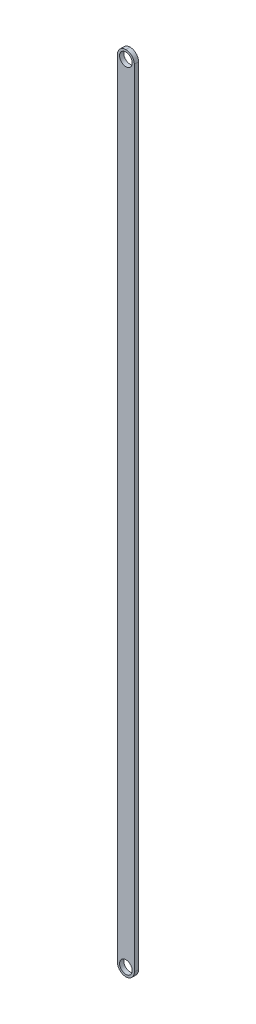
ISO-10303-21;
HEADER;
FILE_DESCRIPTION(('STEP AP214'),'2;1');
FILE_NAME('part.step','',(''),(''),'','','');
FILE_SCHEMA(('AUTOMOTIVE_DESIGN { 1 0 10303 214 1 1 1 1 }'));
ENDSEC;
DATA;
#1=APPLICATION_CONTEXT('core data for automotive mechanical design processes');
#2=APPLICATION_PROTOCOL_DEFINITION('international standard','automotive_design',2000,#1);
#3=PRODUCT_CONTEXT('',#1,'mechanical');
#4=PRODUCT('Part','Part','',(#3));
#5=PRODUCT_RELATED_PRODUCT_CATEGORY('part','',(#4));
#6=PRODUCT_DEFINITION_FORMATION('','',#4);
#7=PRODUCT_DEFINITION_CONTEXT('part definition',#1,'design');
#8=PRODUCT_DEFINITION('design','',#6,#7);
#9=PRODUCT_DEFINITION_SHAPE('','',#8);
#10=(LENGTH_UNIT() NAMED_UNIT(*) SI_UNIT(.MILLI.,.METRE.));
#11=(NAMED_UNIT(*) PLANE_ANGLE_UNIT() SI_UNIT($,.RADIAN.));
#12=(NAMED_UNIT(*) SI_UNIT($,.STERADIAN.) SOLID_ANGLE_UNIT());
#13=UNCERTAINTY_MEASURE_WITH_UNIT(LENGTH_MEASURE(1.E-05),#10,'distance_accuracy_value','');
#14=(GEOMETRIC_REPRESENTATION_CONTEXT(3) GLOBAL_UNCERTAINTY_ASSIGNED_CONTEXT((#13)) GLOBAL_UNIT_ASSIGNED_CONTEXT((#10,
#11,#12)) REPRESENTATION_CONTEXT('',''));
#15=CARTESIAN_POINT('',(0.,0.,0.));
#16=DIRECTION('',(0.,0.,1.));
#17=DIRECTION('',(1.,0.,0.));
#18=AXIS2_PLACEMENT_3D('',#15,#16,#17);
#19=CARTESIAN_POINT('',(0.,0.,0.5));
#20=DIRECTION('',(0.,0.,1.));
#21=DIRECTION('',(1.,0.,0.));
#22=AXIS2_PLACEMENT_3D('',#19,#20,#21);
#23=PLANE('',#22);
#24=CARTESIAN_POINT('',(0.,-46.5000000000005,0.5));
#25=DIRECTION('',(0.,0.,1.));
#26=DIRECTION('',(1.,0.,0.));
#27=AXIS2_PLACEMENT_3D('',#24,#25,#26);
#28=CIRCLE('',#27,0.750000000000001);
#29=CARTESIAN_POINT('',(0.750000000000012,-46.5000000000005,0.5));
#30=VERTEX_POINT('',#29);
#31=EDGE_CURVE('E125',#30,#30,#28,.T.);
#32=ORIENTED_EDGE('',*,*,#31,.F.);
#33=EDGE_LOOP('',(#32));
#34=FACE_BOUND('',#33,.T.);
#35=CARTESIAN_POINT('',(0.,-46.5000000000005,0.5));
#36=DIRECTION('',(0.,0.,1.));
#37=DIRECTION('',(1.,0.,0.));
#38=AXIS2_PLACEMENT_3D('',#35,#36,#37);
#39=CIRCLE('',#38,1.);
#40=CARTESIAN_POINT('',(-1.00000000000001,-46.5000000000005,0.5));
#41=VERTEX_POINT('',#40);
#42=CARTESIAN_POINT('',(0.,-47.5000000000005,0.5));
#43=VERTEX_POINT('',#42);
#44=EDGE_CURVE('E57',#41,#43,#39,.T.);
#45=ORIENTED_EDGE('',*,*,#44,.T.);
#46=CARTESIAN_POINT('',(0.,-46.5000000000005,0.5));
#47=DIRECTION('',(0.,0.,1.));
#48=DIRECTION('',(1.,0.,0.));
#49=AXIS2_PLACEMENT_3D('',#46,#47,#48);
#50=CIRCLE('',#49,1.);
#51=CARTESIAN_POINT('',(0.999999999999992,-46.5000000000005,0.5));
#52=VERTEX_POINT('',#51);
#53=EDGE_CURVE('E153',#43,#52,#50,.T.);
#54=ORIENTED_EDGE('',*,*,#53,.T.);
#55=DIRECTION('',(0.,1.,0.));
#56=VECTOR('',#55,1.);
#57=CARTESIAN_POINT('',(0.999999999999987,47.4999999999995,0.5));
#58=LINE('',#57,#56);
#59=CARTESIAN_POINT('',(0.999999999999987,46.4999999999995,0.5));
#60=VERTEX_POINT('',#59);
#61=EDGE_CURVE('E115',#52,#60,#58,.T.);
#62=ORIENTED_EDGE('',*,*,#61,.T.);
#63=CARTESIAN_POINT('',(0.,46.4999999999995,0.5));
#64=DIRECTION('',(0.,0.,1.));
#65=DIRECTION('',(1.,0.,0.));
#66=AXIS2_PLACEMENT_3D('',#63,#64,#65);
#67=CIRCLE('',#66,1.);
#68=CARTESIAN_POINT('',(0.,47.4999999999995,0.5));
#69=VERTEX_POINT('',#68);
#70=EDGE_CURVE('E105',#60,#69,#67,.T.);
#71=ORIENTED_EDGE('',*,*,#70,.T.);
#72=CARTESIAN_POINT('',(0.,46.4999999999995,0.5));
#73=DIRECTION('',(0.,0.,1.));
#74=DIRECTION('',(1.,0.,0.));
#75=AXIS2_PLACEMENT_3D('',#72,#73,#74);
#76=CIRCLE('',#75,1.);
#77=CARTESIAN_POINT('',(-0.999999999999989,46.4999999999995,0.5));
#78=VERTEX_POINT('',#77);
#79=EDGE_CURVE('E148',#69,#78,#76,.T.);
#80=ORIENTED_EDGE('',*,*,#79,.T.);
#81=DIRECTION('',(0.,-1.,0.));
#82=VECTOR('',#81,1.);
#83=CARTESIAN_POINT('',(-0.999999999999989,47.4999999999995,0.5));
#84=LINE('',#83,#82);
#85=EDGE_CURVE('E134',#78,#41,#84,.T.);
#86=ORIENTED_EDGE('',*,*,#85,.T.);
#87=EDGE_LOOP('',(#45,#54,#62,#71,#80,#86));
#88=FACE_BOUND('',#87,.T.);
#89=CARTESIAN_POINT('',(0.,46.4999999999995,0.5));
#90=DIRECTION('',(0.,0.,1.));
#91=DIRECTION('',(1.,0.,0.));
#92=AXIS2_PLACEMENT_3D('',#89,#90,#91);
#93=CIRCLE('',#92,0.750000000000001);
#94=CARTESIAN_POINT('',(0.75,46.4999999999995,0.5));
#95=VERTEX_POINT('',#94);
#96=EDGE_CURVE('E163',#95,#95,#93,.T.);
#97=ORIENTED_EDGE('',*,*,#96,.F.);
#98=EDGE_LOOP('',(#97));
#99=FACE_BOUND('',#98,.T.);
#100=ADVANCED_FACE('F39',(#34,#88,#99),#23,.T.);
#101=CARTESIAN_POINT('',(0.,0.,0.));
#102=DIRECTION('',(0.,0.,1.));
#103=DIRECTION('',(1.,0.,0.));
#104=AXIS2_PLACEMENT_3D('',#101,#102,#103);
#105=PLANE('',#104);
#106=DIRECTION('',(0.,1.,0.));
#107=VECTOR('',#106,1.);
#108=CARTESIAN_POINT('',(0.999999999999987,47.4999999999995,0.));
#109=LINE('',#108,#107);
#110=CARTESIAN_POINT('',(0.999999999999992,-46.5000000000005,0.));
#111=VERTEX_POINT('',#110);
#112=CARTESIAN_POINT('',(0.999999999999987,46.4999999999995,0.));
#113=VERTEX_POINT('',#112);
#114=EDGE_CURVE('E112',#111,#113,#109,.T.);
#115=ORIENTED_EDGE('',*,*,#114,.F.);
#116=CARTESIAN_POINT('',(0.,-46.5000000000005,0.));
#117=DIRECTION('',(0.,0.,1.));
#118=DIRECTION('',(1.,0.,0.));
#119=AXIS2_PLACEMENT_3D('',#116,#117,#118);
#120=CIRCLE('',#119,1.);
#121=CARTESIAN_POINT('',(0.,-47.5000000000005,0.));
#122=VERTEX_POINT('',#121);
#123=EDGE_CURVE('E95',#111,#122,#120,.F.);
#124=ORIENTED_EDGE('',*,*,#123,.T.);
#125=CARTESIAN_POINT('',(0.,-46.5000000000005,0.));
#126=DIRECTION('',(0.,0.,1.));
#127=DIRECTION('',(1.,0.,0.));
#128=AXIS2_PLACEMENT_3D('',#125,#126,#127);
#129=CIRCLE('',#128,1.);
#130=CARTESIAN_POINT('',(-1.00000000000001,-46.5000000000005,0.));
#131=VERTEX_POINT('',#130);
#132=EDGE_CURVE('E106',#122,#131,#129,.F.);
#133=ORIENTED_EDGE('',*,*,#132,.T.);
#134=DIRECTION('',(0.,-1.,0.));
#135=VECTOR('',#134,1.);
#136=CARTESIAN_POINT('',(-0.999999999999989,47.4999999999995,0.));
#137=LINE('',#136,#135);
#138=CARTESIAN_POINT('',(-0.999999999999989,46.4999999999995,0.));
#139=VERTEX_POINT('',#138);
#140=EDGE_CURVE('E124',#139,#131,#137,.T.);
#141=ORIENTED_EDGE('',*,*,#140,.F.);
#142=CARTESIAN_POINT('',(0.,46.4999999999995,0.));
#143=DIRECTION('',(0.,0.,1.));
#144=DIRECTION('',(1.,0.,0.));
#145=AXIS2_PLACEMENT_3D('',#142,#143,#144);
#146=CIRCLE('',#145,1.);
#147=CARTESIAN_POINT('',(0.,47.4999999999995,0.));
#148=VERTEX_POINT('',#147);
#149=EDGE_CURVE('E141',#139,#148,#146,.F.);
#150=ORIENTED_EDGE('',*,*,#149,.T.);
#151=CARTESIAN_POINT('',(0.,46.4999999999995,0.));
#152=DIRECTION('',(0.,0.,1.));
#153=DIRECTION('',(1.,0.,0.));
#154=AXIS2_PLACEMENT_3D('',#151,#152,#153);
#155=CIRCLE('',#154,1.);
#156=EDGE_CURVE('E117',#148,#113,#155,.F.);
#157=ORIENTED_EDGE('',*,*,#156,.T.);
#158=EDGE_LOOP('',(#115,#124,#133,#141,#150,#157));
#159=FACE_BOUND('',#158,.T.);
#160=CARTESIAN_POINT('',(0.,-46.5000000000005,0.));
#161=DIRECTION('',(0.,0.,1.));
#162=DIRECTION('',(1.,0.,0.));
#163=AXIS2_PLACEMENT_3D('',#160,#161,#162);
#164=CIRCLE('',#163,0.750000000000001);
#165=CARTESIAN_POINT('',(0.750000000000012,-46.5000000000005,0.));
#166=VERTEX_POINT('',#165);
#167=EDGE_CURVE('E131',#166,#166,#164,.T.);
#168=ORIENTED_EDGE('',*,*,#167,.T.);
#169=EDGE_LOOP('',(#168));
#170=FACE_BOUND('',#169,.T.);
#171=CARTESIAN_POINT('',(0.,46.4999999999995,0.));
#172=DIRECTION('',(0.,0.,1.));
#173=DIRECTION('',(1.,0.,0.));
#174=AXIS2_PLACEMENT_3D('',#171,#172,#173);
#175=CIRCLE('',#174,0.750000000000001);
#176=CARTESIAN_POINT('',(0.75,46.4999999999995,0.));
#177=VERTEX_POINT('',#176);
#178=EDGE_CURVE('E159',#177,#177,#175,.T.);
#179=ORIENTED_EDGE('',*,*,#178,.T.);
#180=EDGE_LOOP('',(#179));
#181=FACE_BOUND('',#180,.T.);
#182=ADVANCED_FACE('F120',(#159,#170,#181),#105,.F.);
#183=CARTESIAN_POINT('',(0.999999999999987,47.4999999999995,0.5));
#184=DIRECTION('',(-1.,0.,0.));
#185=DIRECTION('',(0.,-1.,0.));
#186=AXIS2_PLACEMENT_3D('',#183,#184,#185);
#187=PLANE('',#186);
#188=ORIENTED_EDGE('',*,*,#61,.F.);
#189=DIRECTION('',(0.,0.,-1.));
#190=VECTOR('',#189,1.);
#191=CARTESIAN_POINT('',(0.999999999999992,-46.5000000000005,0.5));
#192=LINE('',#191,#190);
#193=EDGE_CURVE('E99',#52,#111,#192,.T.);
#194=ORIENTED_EDGE('',*,*,#193,.T.);
#195=ORIENTED_EDGE('',*,*,#114,.T.);
#196=DIRECTION('',(0.,0.,-1.));
#197=VECTOR('',#196,1.);
#198=CARTESIAN_POINT('',(0.999999999999987,46.4999999999995,0.5));
#199=LINE('',#198,#197);
#200=EDGE_CURVE('E118',#113,#60,#199,.F.);
#201=ORIENTED_EDGE('',*,*,#200,.T.);
#202=EDGE_LOOP('',(#188,#194,#195,#201));
#203=FACE_BOUND('',#202,.T.);
#204=ADVANCED_FACE('F111',(#203),#187,.F.);
#205=CARTESIAN_POINT('',(-0.999999999999989,47.4999999999995,0.5));
#206=DIRECTION('',(1.,0.,0.));
#207=DIRECTION('',(0.,1.,0.));
#208=AXIS2_PLACEMENT_3D('',#205,#206,#207);
#209=PLANE('',#208);
#210=ORIENTED_EDGE('',*,*,#140,.T.);
#211=DIRECTION('',(0.,0.,-1.));
#212=VECTOR('',#211,1.);
#213=CARTESIAN_POINT('',(-1.00000000000001,-46.5000000000005,0.5));
#214=LINE('',#213,#212);
#215=EDGE_CURVE('E11',#131,#41,#214,.F.);
#216=ORIENTED_EDGE('',*,*,#215,.T.);
#217=ORIENTED_EDGE('',*,*,#85,.F.);
#218=DIRECTION('',(0.,0.,-1.));
#219=VECTOR('',#218,1.);
#220=CARTESIAN_POINT('',(-0.999999999999989,46.4999999999995,0.5));
#221=LINE('',#220,#219);
#222=EDGE_CURVE('E49',#78,#139,#221,.T.);
#223=ORIENTED_EDGE('',*,*,#222,.T.);
#224=EDGE_LOOP('',(#210,#216,#217,#223));
#225=FACE_BOUND('',#224,.T.);
#226=ADVANCED_FACE('F198',(#225),#209,.F.);
#227=CARTESIAN_POINT('',(0.,-46.5000000000005,0.5));
#228=DIRECTION('',(0.,0.,-1.));
#229=DIRECTION('',(-1.,0.,0.));
#230=AXIS2_PLACEMENT_3D('',#227,#228,#229);
#231=CYLINDRICAL_SURFACE('',#230,0.750000000000001);
#232=ORIENTED_EDGE('',*,*,#31,.T.);
#233=EDGE_LOOP('',(#232));
#234=FACE_BOUND('',#233,.T.);
#235=ORIENTED_EDGE('',*,*,#167,.F.);
#236=EDGE_LOOP('',(#235));
#237=FACE_BOUND('',#236,.T.);
#238=ADVANCED_FACE('F195',(#234,#237),#231,.F.);
#239=CARTESIAN_POINT('',(0.,46.4999999999995,0.5));
#240=DIRECTION('',(0.,0.,-1.));
#241=DIRECTION('',(-1.,0.,0.));
#242=AXIS2_PLACEMENT_3D('',#239,#240,#241);
#243=CYLINDRICAL_SURFACE('',#242,0.750000000000001);
#244=ORIENTED_EDGE('',*,*,#96,.T.);
#245=EDGE_LOOP('',(#244));
#246=FACE_BOUND('',#245,.T.);
#247=ORIENTED_EDGE('',*,*,#178,.F.);
#248=EDGE_LOOP('',(#247));
#249=FACE_BOUND('',#248,.T.);
#250=ADVANCED_FACE('F184',(#246,#249),#243,.F.);
#251=CARTESIAN_POINT('',(0.,-46.5000000000005,0.5));
#252=DIRECTION('',(0.,0.,-1.));
#253=DIRECTION('',(-1.,0.,0.));
#254=AXIS2_PLACEMENT_3D('',#251,#252,#253);
#255=CYLINDRICAL_SURFACE('',#254,1.);
#256=DIRECTION('',(0.,0.,-1.));
#257=VECTOR('',#256,1.);
#258=CARTESIAN_POINT('',(0.,-47.5000000000005,0.5));
#259=LINE('',#258,#257);
#260=EDGE_CURVE('E100',#43,#122,#259,.T.);
#261=ORIENTED_EDGE('',*,*,#260,.F.);
#262=ORIENTED_EDGE('',*,*,#44,.F.);
#263=ORIENTED_EDGE('',*,*,#215,.F.);
#264=ORIENTED_EDGE('',*,*,#132,.F.);
#265=EDGE_LOOP('',(#261,#262,#263,#264));
#266=FACE_BOUND('',#265,.T.);
#267=ADVANCED_FACE('F205',(#266),#255,.T.);
#268=CARTESIAN_POINT('',(0.,-46.5000000000005,0.5));
#269=DIRECTION('',(0.,0.,-1.));
#270=DIRECTION('',(-1.,0.,0.));
#271=AXIS2_PLACEMENT_3D('',#268,#269,#270);
#272=CYLINDRICAL_SURFACE('',#271,1.);
#273=ORIENTED_EDGE('',*,*,#53,.F.);
#274=ORIENTED_EDGE('',*,*,#260,.T.);
#275=ORIENTED_EDGE('',*,*,#123,.F.);
#276=ORIENTED_EDGE('',*,*,#193,.F.);
#277=EDGE_LOOP('',(#273,#274,#275,#276));
#278=FACE_BOUND('',#277,.T.);
#279=ADVANCED_FACE('F98',(#278),#272,.T.);
#280=CARTESIAN_POINT('',(0.,46.4999999999995,0.5));
#281=DIRECTION('',(0.,0.,-1.));
#282=DIRECTION('',(-1.,0.,0.));
#283=AXIS2_PLACEMENT_3D('',#280,#281,#282);
#284=CYLINDRICAL_SURFACE('',#283,1.);
#285=DIRECTION('',(0.,0.,-1.));
#286=VECTOR('',#285,1.);
#287=CARTESIAN_POINT('',(0.,47.4999999999995,0.5));
#288=LINE('',#287,#286);
#289=EDGE_CURVE('E43',#69,#148,#288,.T.);
#290=ORIENTED_EDGE('',*,*,#289,.F.);
#291=ORIENTED_EDGE('',*,*,#70,.F.);
#292=ORIENTED_EDGE('',*,*,#200,.F.);
#293=ORIENTED_EDGE('',*,*,#156,.F.);
#294=EDGE_LOOP('',(#290,#291,#292,#293));
#295=FACE_BOUND('',#294,.T.);
#296=ADVANCED_FACE('F41',(#295),#284,.T.);
#297=CARTESIAN_POINT('',(0.,46.4999999999995,0.5));
#298=DIRECTION('',(0.,0.,-1.));
#299=DIRECTION('',(-1.,0.,0.));
#300=AXIS2_PLACEMENT_3D('',#297,#298,#299);
#301=CYLINDRICAL_SURFACE('',#300,1.);
#302=ORIENTED_EDGE('',*,*,#79,.F.);
#303=ORIENTED_EDGE('',*,*,#289,.T.);
#304=ORIENTED_EDGE('',*,*,#149,.F.);
#305=ORIENTED_EDGE('',*,*,#222,.F.);
#306=EDGE_LOOP('',(#302,#303,#304,#305));
#307=FACE_BOUND('',#306,.T.);
#308=ADVANCED_FACE('F169',(#307),#301,.T.);
#309=CLOSED_SHELL('',(#100,#182,#204,#226,#238,#250,#267,#279,#296,#308));
#310=MANIFOLD_SOLID_BREP('B2',#309);
#311=ADVANCED_BREP_SHAPE_REPRESENTATION('',(#18,#310),#14);
#312=SHAPE_DEFINITION_REPRESENTATION(#9,#311);
ENDSEC;
END-ISO-10303-21;
